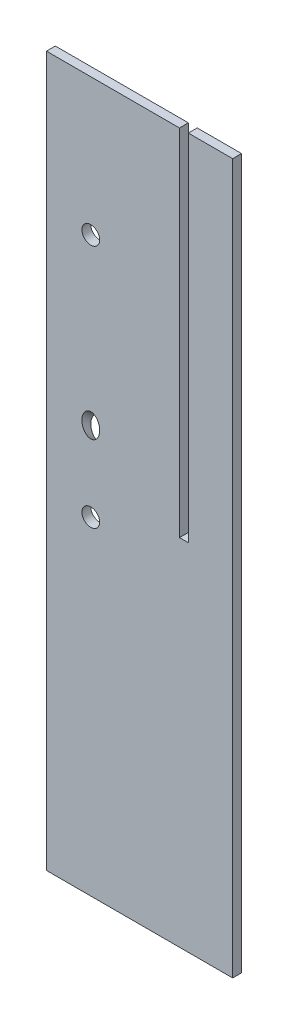
ISO-10303-21;
HEADER;
FILE_DESCRIPTION(('STEP AP214'),'2;1');
FILE_NAME('part.step','',(''),(''),'','','');
FILE_SCHEMA(('AUTOMOTIVE_DESIGN { 1 0 10303 214 1 1 1 1 }'));
ENDSEC;
DATA;
#1=APPLICATION_CONTEXT('core data for automotive mechanical design processes');
#2=APPLICATION_PROTOCOL_DEFINITION('international standard','automotive_design',2000,#1);
#3=PRODUCT_CONTEXT('',#1,'mechanical');
#4=PRODUCT('Part','Part','',(#3));
#5=PRODUCT_RELATED_PRODUCT_CATEGORY('part','',(#4));
#6=PRODUCT_DEFINITION_FORMATION('','',#4);
#7=PRODUCT_DEFINITION_CONTEXT('part definition',#1,'design');
#8=PRODUCT_DEFINITION('design','',#6,#7);
#9=PRODUCT_DEFINITION_SHAPE('','',#8);
#10=(LENGTH_UNIT() NAMED_UNIT(*) SI_UNIT(.MILLI.,.METRE.));
#11=(NAMED_UNIT(*) PLANE_ANGLE_UNIT() SI_UNIT($,.RADIAN.));
#12=(NAMED_UNIT(*) SI_UNIT($,.STERADIAN.) SOLID_ANGLE_UNIT());
#13=UNCERTAINTY_MEASURE_WITH_UNIT(LENGTH_MEASURE(1.E-05),#10,'distance_accuracy_value','');
#14=(GEOMETRIC_REPRESENTATION_CONTEXT(3) GLOBAL_UNCERTAINTY_ASSIGNED_CONTEXT((#13)) GLOBAL_UNIT_ASSIGNED_CONTEXT((#10,
#11,#12)) REPRESENTATION_CONTEXT('',''));
#15=CARTESIAN_POINT('',(0.,0.,0.));
#16=DIRECTION('',(0.,0.,1.));
#17=DIRECTION('',(1.,0.,0.));
#18=AXIS2_PLACEMENT_3D('',#15,#16,#17);
#19=CARTESIAN_POINT('',(-133.35,1016.,6.35));
#20=DIRECTION('',(0.,-1.,0.));
#21=DIRECTION('',(0.,0.,-1.));
#22=AXIS2_PLACEMENT_3D('',#19,#20,#21);
#23=PLANE('',#22);
#24=DIRECTION('',(-1.,0.,0.));
#25=VECTOR('',#24,1.);
#26=CARTESIAN_POINT('',(-133.35,1016.,-6.35));
#27=LINE('',#26,#25);
#28=CARTESIAN_POINT('',(133.35,1016.,-6.35));
#29=VERTEX_POINT('',#28);
#30=CARTESIAN_POINT('',(69.85,1016.,-6.35000000000002));
#31=VERTEX_POINT('',#30);
#32=EDGE_CURVE('E112',#29,#31,#27,.T.);
#33=ORIENTED_EDGE('',*,*,#32,.T.);
#34=DIRECTION('',(0.,0.,1.));
#35=VECTOR('',#34,1.);
#36=CARTESIAN_POINT('',(69.85,1016.,-6.35000000000002));
#37=LINE('',#36,#35);
#38=CARTESIAN_POINT('',(69.85,1016.,6.35000000000002));
#39=VERTEX_POINT('',#38);
#40=EDGE_CURVE('E182',#31,#39,#37,.T.);
#41=ORIENTED_EDGE('',*,*,#40,.T.);
#42=DIRECTION('',(-1.,0.,0.));
#43=VECTOR('',#42,1.);
#44=CARTESIAN_POINT('',(-133.35,1016.,6.35));
#45=LINE('',#44,#43);
#46=CARTESIAN_POINT('',(133.35,1016.,6.35));
#47=VERTEX_POINT('',#46);
#48=EDGE_CURVE('E131',#47,#39,#45,.T.);
#49=ORIENTED_EDGE('',*,*,#48,.F.);
#50=DIRECTION('',(0.,0.,-1.));
#51=VECTOR('',#50,1.);
#52=CARTESIAN_POINT('',(133.35,1016.,6.35));
#53=LINE('',#52,#51);
#54=EDGE_CURVE('E139',#47,#29,#53,.T.);
#55=ORIENTED_EDGE('',*,*,#54,.T.);
#56=EDGE_LOOP('',(#33,#41,#49,#55));
#57=FACE_BOUND('',#56,.T.);
#58=ADVANCED_FACE('F37',(#57),#23,.F.);
#59=CARTESIAN_POINT('',(-133.35,0.,6.35));
#60=DIRECTION('',(1.,0.,0.));
#61=DIRECTION('',(0.,1.,0.));
#62=AXIS2_PLACEMENT_3D('',#59,#60,#61);
#63=PLANE('',#62);
#64=DIRECTION('',(0.,-1.,0.));
#65=VECTOR('',#64,1.);
#66=CARTESIAN_POINT('',(-133.35,0.,-6.35));
#67=LINE('',#66,#65);
#68=CARTESIAN_POINT('',(-133.35,1016.,-6.35));
#69=VERTEX_POINT('',#68);
#70=CARTESIAN_POINT('',(-133.35,0.,-6.35));
#71=VERTEX_POINT('',#70);
#72=EDGE_CURVE('E119',#69,#71,#67,.T.);
#73=ORIENTED_EDGE('',*,*,#72,.T.);
#74=DIRECTION('',(0.,0.,-1.));
#75=VECTOR('',#74,1.);
#76=CARTESIAN_POINT('',(-133.35,0.,6.35));
#77=LINE('',#76,#75);
#78=CARTESIAN_POINT('',(-133.35,0.,6.35));
#79=VERTEX_POINT('',#78);
#80=EDGE_CURVE('E156',#79,#71,#77,.T.);
#81=ORIENTED_EDGE('',*,*,#80,.F.);
#82=DIRECTION('',(0.,-1.,0.));
#83=VECTOR('',#82,1.);
#84=CARTESIAN_POINT('',(-133.35,0.,6.35));
#85=LINE('',#84,#83);
#86=CARTESIAN_POINT('',(-133.35,1016.,6.35));
#87=VERTEX_POINT('',#86);
#88=EDGE_CURVE('E120',#87,#79,#85,.T.);
#89=ORIENTED_EDGE('',*,*,#88,.F.);
#90=DIRECTION('',(0.,0.,-1.));
#91=VECTOR('',#90,1.);
#92=CARTESIAN_POINT('',(-133.35,1016.,6.35));
#93=LINE('',#92,#91);
#94=EDGE_CURVE('E107',#87,#69,#93,.T.);
#95=ORIENTED_EDGE('',*,*,#94,.T.);
#96=EDGE_LOOP('',(#73,#81,#89,#95));
#97=FACE_BOUND('',#96,.T.);
#98=ADVANCED_FACE('F117',(#97),#63,.F.);
#99=CARTESIAN_POINT('',(-133.35,0.,6.35));
#100=DIRECTION('',(0.,1.,0.));
#101=DIRECTION('',(-1.,0.,0.));
#102=AXIS2_PLACEMENT_3D('',#99,#100,#101);
#103=PLANE('',#102);
#104=DIRECTION('',(1.,0.,0.));
#105=VECTOR('',#104,1.);
#106=CARTESIAN_POINT('',(-133.35,0.,-6.35));
#107=LINE('',#106,#105);
#108=CARTESIAN_POINT('',(133.35,0.,-6.35));
#109=VERTEX_POINT('',#108);
#110=EDGE_CURVE('E63',#71,#109,#107,.T.);
#111=ORIENTED_EDGE('',*,*,#110,.T.);
#112=DIRECTION('',(0.,0.,-1.));
#113=VECTOR('',#112,1.);
#114=CARTESIAN_POINT('',(133.35,0.,6.35));
#115=LINE('',#114,#113);
#116=CARTESIAN_POINT('',(133.35,0.,6.35));
#117=VERTEX_POINT('',#116);
#118=EDGE_CURVE('E113',#117,#109,#115,.T.);
#119=ORIENTED_EDGE('',*,*,#118,.F.);
#120=DIRECTION('',(1.,0.,0.));
#121=VECTOR('',#120,1.);
#122=CARTESIAN_POINT('',(-133.35,0.,6.35));
#123=LINE('',#122,#121);
#124=EDGE_CURVE('E82',#79,#117,#123,.T.);
#125=ORIENTED_EDGE('',*,*,#124,.F.);
#126=ORIENTED_EDGE('',*,*,#80,.T.);
#127=EDGE_LOOP('',(#111,#119,#125,#126));
#128=FACE_BOUND('',#127,.T.);
#129=ADVANCED_FACE('F231',(#128),#103,.F.);
#130=CARTESIAN_POINT('',(133.35,0.,6.35));
#131=DIRECTION('',(-1.,0.,0.));
#132=DIRECTION('',(0.,0.,1.));
#133=AXIS2_PLACEMENT_3D('',#130,#131,#132);
#134=PLANE('',#133);
#135=DIRECTION('',(0.,1.,0.));
#136=VECTOR('',#135,1.);
#137=CARTESIAN_POINT('',(133.35,0.,-6.35));
#138=LINE('',#137,#136);
#139=EDGE_CURVE('E158',#109,#29,#138,.T.);
#140=ORIENTED_EDGE('',*,*,#139,.T.);
#141=ORIENTED_EDGE('',*,*,#54,.F.);
#142=DIRECTION('',(0.,1.,0.));
#143=VECTOR('',#142,1.);
#144=CARTESIAN_POINT('',(133.35,0.,6.35));
#145=LINE('',#144,#143);
#146=EDGE_CURVE('E136',#117,#47,#145,.T.);
#147=ORIENTED_EDGE('',*,*,#146,.F.);
#148=ORIENTED_EDGE('',*,*,#118,.T.);
#149=EDGE_LOOP('',(#140,#141,#147,#148));
#150=FACE_BOUND('',#149,.T.);
#151=ADVANCED_FACE('F164',(#150),#134,.F.);
#152=CARTESIAN_POINT('',(57.15,1016.,6.35000000000002));
#153=VERTEX_POINT('',#152);
#154=EDGE_CURVE('E135',#153,#87,#45,.T.);
#155=ORIENTED_EDGE('',*,*,#154,.F.);
#156=DIRECTION('',(0.,0.,1.));
#157=VECTOR('',#156,1.);
#158=CARTESIAN_POINT('',(57.15,1016.,-6.35000000000002));
#159=LINE('',#158,#157);
#160=CARTESIAN_POINT('',(57.15,1016.,-6.35000000000002));
#161=VERTEX_POINT('',#160);
#162=EDGE_CURVE('E110',#161,#153,#159,.T.);
#163=ORIENTED_EDGE('',*,*,#162,.F.);
#164=EDGE_CURVE('E103',#161,#69,#27,.T.);
#165=ORIENTED_EDGE('',*,*,#164,.T.);
#166=ORIENTED_EDGE('',*,*,#94,.F.);
#167=EDGE_LOOP('',(#155,#163,#165,#166));
#168=FACE_BOUND('',#167,.T.);
#169=ADVANCED_FACE('F106',(#168),#23,.F.);
#170=CARTESIAN_POINT('',(0.,0.,6.35));
#171=DIRECTION('',(0.,0.,-1.));
#172=DIRECTION('',(-1.,0.,0.));
#173=AXIS2_PLACEMENT_3D('',#170,#171,#172);
#174=PLANE('',#173);
#175=CARTESIAN_POINT('',(-69.85,469.899999999998,6.35000000000002));
#176=DIRECTION('',(0.,0.,-1.));
#177=DIRECTION('',(-1.,0.,0.));
#178=AXIS2_PLACEMENT_3D('',#175,#176,#177);
#179=CIRCLE('',#178,12.7);
#180=CARTESIAN_POINT('',(-82.55,469.899999999998,6.35000000000002));
#181=VERTEX_POINT('',#180);
#182=EDGE_CURVE('E11',#181,#181,#179,.F.);
#183=ORIENTED_EDGE('',*,*,#182,.F.);
#184=EDGE_LOOP('',(#183));
#185=FACE_BOUND('',#184,.T.);
#186=CARTESIAN_POINT('',(-69.85,583.781250000006,6.35000000000002));
#187=DIRECTION('',(0.,0.,-1.));
#188=DIRECTION('',(0.,-1.,0.));
#189=AXIS2_PLACEMENT_3D('',#186,#187,#188);
#190=ELLIPSE('',#189,16.8753564777163,12.7);
#191=CARTESIAN_POINT('',(-69.85,566.905893522289,6.35000000000002));
#192=VERTEX_POINT('',#191);
#193=EDGE_CURVE('E46',#192,#192,#190,.F.);
#194=ORIENTED_EDGE('',*,*,#193,.F.);
#195=EDGE_LOOP('',(#194));
#196=FACE_BOUND('',#195,.T.);
#197=CARTESIAN_POINT('',(-69.85,819.899999999998,6.35000000000002));
#198=DIRECTION('',(0.,0.,-1.));
#199=DIRECTION('',(-1.,0.,0.));
#200=AXIS2_PLACEMENT_3D('',#197,#198,#199);
#201=CIRCLE('',#200,12.7);
#202=CARTESIAN_POINT('',(-82.55,819.899999999998,6.35000000000002));
#203=VERTEX_POINT('',#202);
#204=EDGE_CURVE('E41',#203,#203,#201,.F.);
#205=ORIENTED_EDGE('',*,*,#204,.F.);
#206=EDGE_LOOP('',(#205));
#207=FACE_BOUND('',#206,.T.);
#208=ORIENTED_EDGE('',*,*,#48,.T.);
#209=DIRECTION('',(0.,1.,0.));
#210=VECTOR('',#209,1.);
#211=CARTESIAN_POINT('',(69.85,1016.,6.35000000000002));
#212=LINE('',#211,#210);
#213=CARTESIAN_POINT('',(69.8500000000001,508.,6.35000000000002));
#214=VERTEX_POINT('',#213);
#215=EDGE_CURVE('E206',#214,#39,#212,.T.);
#216=ORIENTED_EDGE('',*,*,#215,.F.);
#217=DIRECTION('',(1.,0.,0.));
#218=VECTOR('',#217,1.);
#219=CARTESIAN_POINT('',(69.8500000000001,508.,6.35000000000002));
#220=LINE('',#219,#218);
#221=CARTESIAN_POINT('',(57.15,508.,6.35000000000002));
#222=VERTEX_POINT('',#221);
#223=EDGE_CURVE('E175',#222,#214,#220,.T.);
#224=ORIENTED_EDGE('',*,*,#223,.F.);
#225=DIRECTION('',(0.,-1.,0.));
#226=VECTOR('',#225,1.);
#227=CARTESIAN_POINT('',(57.15,1016.,6.35000000000002));
#228=LINE('',#227,#226);
#229=EDGE_CURVE('E178',#153,#222,#228,.T.);
#230=ORIENTED_EDGE('',*,*,#229,.F.);
#231=ORIENTED_EDGE('',*,*,#154,.T.);
#232=ORIENTED_EDGE('',*,*,#88,.T.);
#233=ORIENTED_EDGE('',*,*,#124,.T.);
#234=ORIENTED_EDGE('',*,*,#146,.T.);
#235=EDGE_LOOP('',(#208,#216,#224,#230,#231,#232,#233,#234));
#236=FACE_BOUND('',#235,.T.);
#237=ADVANCED_FACE('F39',(#185,#196,#207,#236),#174,.F.);
#238=CARTESIAN_POINT('',(0.,0.,-6.35));
#239=DIRECTION('',(0.,0.,-1.));
#240=DIRECTION('',(-1.,0.,0.));
#241=AXIS2_PLACEMENT_3D('',#238,#239,#240);
#242=PLANE('',#241);
#243=DIRECTION('',(0.,1.,0.));
#244=VECTOR('',#243,1.);
#245=CARTESIAN_POINT('',(69.85,1016.,-6.35000000000002));
#246=LINE('',#245,#244);
#247=CARTESIAN_POINT('',(69.8500000000001,508.,-6.35000000000002));
#248=VERTEX_POINT('',#247);
#249=EDGE_CURVE('E170',#248,#31,#246,.T.);
#250=ORIENTED_EDGE('',*,*,#249,.T.);
#251=ORIENTED_EDGE('',*,*,#32,.F.);
#252=ORIENTED_EDGE('',*,*,#139,.F.);
#253=ORIENTED_EDGE('',*,*,#110,.F.);
#254=ORIENTED_EDGE('',*,*,#72,.F.);
#255=ORIENTED_EDGE('',*,*,#164,.F.);
#256=DIRECTION('',(0.,-1.,0.));
#257=VECTOR('',#256,1.);
#258=CARTESIAN_POINT('',(57.15,1016.,-6.35000000000002));
#259=LINE('',#258,#257);
#260=CARTESIAN_POINT('',(57.15,508.,-6.35));
#261=VERTEX_POINT('',#260);
#262=EDGE_CURVE('E174',#161,#261,#259,.T.);
#263=ORIENTED_EDGE('',*,*,#262,.T.);
#264=DIRECTION('',(1.,0.,0.));
#265=VECTOR('',#264,1.);
#266=CARTESIAN_POINT('',(69.8500000000001,508.,-6.35000000000002));
#267=LINE('',#266,#265);
#268=EDGE_CURVE('E54',#261,#248,#267,.T.);
#269=ORIENTED_EDGE('',*,*,#268,.T.);
#270=EDGE_LOOP('',(#250,#251,#252,#253,#254,#255,#263,#269));
#271=FACE_BOUND('',#270,.T.);
#272=CARTESIAN_POINT('',(-69.85,469.899999999998,-6.35000000000002));
#273=DIRECTION('',(0.,0.,-1.));
#274=DIRECTION('',(-1.,0.,0.));
#275=AXIS2_PLACEMENT_3D('',#272,#273,#274);
#276=CIRCLE('',#275,12.7);
#277=CARTESIAN_POINT('',(-82.55,469.899999999998,-6.35000000000002));
#278=VERTEX_POINT('',#277);
#279=EDGE_CURVE('E134',#278,#278,#276,.F.);
#280=ORIENTED_EDGE('',*,*,#279,.T.);
#281=EDGE_LOOP('',(#280));
#282=FACE_BOUND('',#281,.T.);
#283=CARTESIAN_POINT('',(-69.85,572.668750000006,-6.35000000000002));
#284=DIRECTION('',(0.,0.,-1.));
#285=DIRECTION('',(0.,-1.,0.));
#286=AXIS2_PLACEMENT_3D('',#283,#284,#285);
#287=ELLIPSE('',#286,16.8753564777163,12.7);
#288=CARTESIAN_POINT('',(-69.85,555.793393522289,-6.35000000000002));
#289=VERTEX_POINT('',#288);
#290=EDGE_CURVE('E148',#289,#289,#287,.F.);
#291=ORIENTED_EDGE('',*,*,#290,.T.);
#292=EDGE_LOOP('',(#291));
#293=FACE_BOUND('',#292,.T.);
#294=CARTESIAN_POINT('',(-69.85,819.899999999998,-6.35000000000002));
#295=DIRECTION('',(0.,0.,-1.));
#296=DIRECTION('',(-1.,0.,0.));
#297=AXIS2_PLACEMENT_3D('',#294,#295,#296);
#298=CIRCLE('',#297,12.7);
#299=CARTESIAN_POINT('',(-82.55,819.899999999998,-6.35000000000002));
#300=VERTEX_POINT('',#299);
#301=EDGE_CURVE('E144',#300,#300,#298,.F.);
#302=ORIENTED_EDGE('',*,*,#301,.T.);
#303=EDGE_LOOP('',(#302));
#304=FACE_BOUND('',#303,.T.);
#305=ADVANCED_FACE('F123',(#271,#282,#293,#304),#242,.T.);
#306=CARTESIAN_POINT('',(-69.8499999999999,819.899999999998,276.199999999991));
#307=DIRECTION('',(0.,0.,-1.));
#308=DIRECTION('',(-1.,0.,0.));
#309=AXIS2_PLACEMENT_3D('',#306,#307,#308);
#310=CYLINDRICAL_SURFACE('',#309,12.7);
#311=ORIENTED_EDGE('',*,*,#301,.F.);
#312=EDGE_LOOP('',(#311));
#313=FACE_BOUND('',#312,.T.);
#314=ORIENTED_EDGE('',*,*,#204,.T.);
#315=EDGE_LOOP('',(#314));
#316=FACE_BOUND('',#315,.T.);
#317=ADVANCED_FACE('F284',(#313,#316),#310,.F.);
#318=CARTESIAN_POINT('',(-69.8499999999999,819.899999999998,276.199999999991));
#319=DIRECTION('',(0.,-0.658504607868519,-0.752576694706877));
#320=DIRECTION('',(0.,0.752576694706877,-0.658504607868519));
#321=AXIS2_PLACEMENT_3D('',#318,#319,#320);
#322=CYLINDRICAL_SURFACE('',#321,12.7);
#323=ORIENTED_EDGE('',*,*,#290,.F.);
#324=EDGE_LOOP('',(#323));
#325=FACE_BOUND('',#324,.T.);
#326=ORIENTED_EDGE('',*,*,#193,.T.);
#327=EDGE_LOOP('',(#326));
#328=FACE_BOUND('',#327,.T.);
#329=ADVANCED_FACE('F194',(#325,#328),#322,.F.);
#330=CARTESIAN_POINT('',(-69.8499999999999,469.899999999998,276.199999999994));
#331=DIRECTION('',(0.,0.,-1.));
#332=DIRECTION('',(-1.,0.,0.));
#333=AXIS2_PLACEMENT_3D('',#330,#331,#332);
#334=CYLINDRICAL_SURFACE('',#333,12.7);
#335=ORIENTED_EDGE('',*,*,#279,.F.);
#336=EDGE_LOOP('',(#335));
#337=FACE_BOUND('',#336,.T.);
#338=ORIENTED_EDGE('',*,*,#182,.T.);
#339=EDGE_LOOP('',(#338));
#340=FACE_BOUND('',#339,.T.);
#341=ADVANCED_FACE('F190',(#337,#340),#334,.F.);
#342=CARTESIAN_POINT('',(69.85,1016.,-6.35000000000002));
#343=DIRECTION('',(1.,0.,0.));
#344=DIRECTION('',(0.,1.,0.));
#345=AXIS2_PLACEMENT_3D('',#342,#343,#344);
#346=PLANE('',#345);
#347=ORIENTED_EDGE('',*,*,#40,.F.);
#348=ORIENTED_EDGE('',*,*,#249,.F.);
#349=DIRECTION('',(0.,0.,1.));
#350=VECTOR('',#349,1.);
#351=CARTESIAN_POINT('',(69.8500000000001,508.,-6.35000000000002));
#352=LINE('',#351,#350);
#353=EDGE_CURVE('E91',#248,#214,#352,.T.);
#354=ORIENTED_EDGE('',*,*,#353,.T.);
#355=ORIENTED_EDGE('',*,*,#215,.T.);
#356=EDGE_LOOP('',(#347,#348,#354,#355));
#357=FACE_BOUND('',#356,.T.);
#358=ADVANCED_FACE('F193',(#357),#346,.F.);
#359=CARTESIAN_POINT('',(69.8500000000001,508.,-6.35000000000002));
#360=DIRECTION('',(0.,-1.,0.));
#361=DIRECTION('',(0.,0.,-1.));
#362=AXIS2_PLACEMENT_3D('',#359,#360,#361);
#363=PLANE('',#362);
#364=ORIENTED_EDGE('',*,*,#353,.F.);
#365=ORIENTED_EDGE('',*,*,#268,.F.);
#366=DIRECTION('',(0.,0.,1.));
#367=VECTOR('',#366,1.);
#368=CARTESIAN_POINT('',(57.15,508.,-6.35000000000002));
#369=LINE('',#368,#367);
#370=EDGE_CURVE('E126',#261,#222,#369,.T.);
#371=ORIENTED_EDGE('',*,*,#370,.T.);
#372=ORIENTED_EDGE('',*,*,#223,.T.);
#373=EDGE_LOOP('',(#364,#365,#371,#372));
#374=FACE_BOUND('',#373,.T.);
#375=ADVANCED_FACE('F213',(#374),#363,.F.);
#376=CARTESIAN_POINT('',(57.15,1016.,-6.35000000000002));
#377=DIRECTION('',(-1.,0.,0.));
#378=DIRECTION('',(0.,-1.,0.));
#379=AXIS2_PLACEMENT_3D('',#376,#377,#378);
#380=PLANE('',#379);
#381=ORIENTED_EDGE('',*,*,#370,.F.);
#382=ORIENTED_EDGE('',*,*,#262,.F.);
#383=ORIENTED_EDGE('',*,*,#162,.T.);
#384=ORIENTED_EDGE('',*,*,#229,.T.);
#385=EDGE_LOOP('',(#381,#382,#383,#384));
#386=FACE_BOUND('',#385,.T.);
#387=ADVANCED_FACE('F218',(#386),#380,.F.);
#388=CLOSED_SHELL('',(#58,#98,#129,#151,#169,#237,#305,#317,#329,#341,#358,#375,#387));
#389=MANIFOLD_SOLID_BREP('B2',#388);
#390=ADVANCED_BREP_SHAPE_REPRESENTATION('',(#18,#389),#14);
#391=SHAPE_DEFINITION_REPRESENTATION(#9,#390);
ENDSEC;
END-ISO-10303-21;
